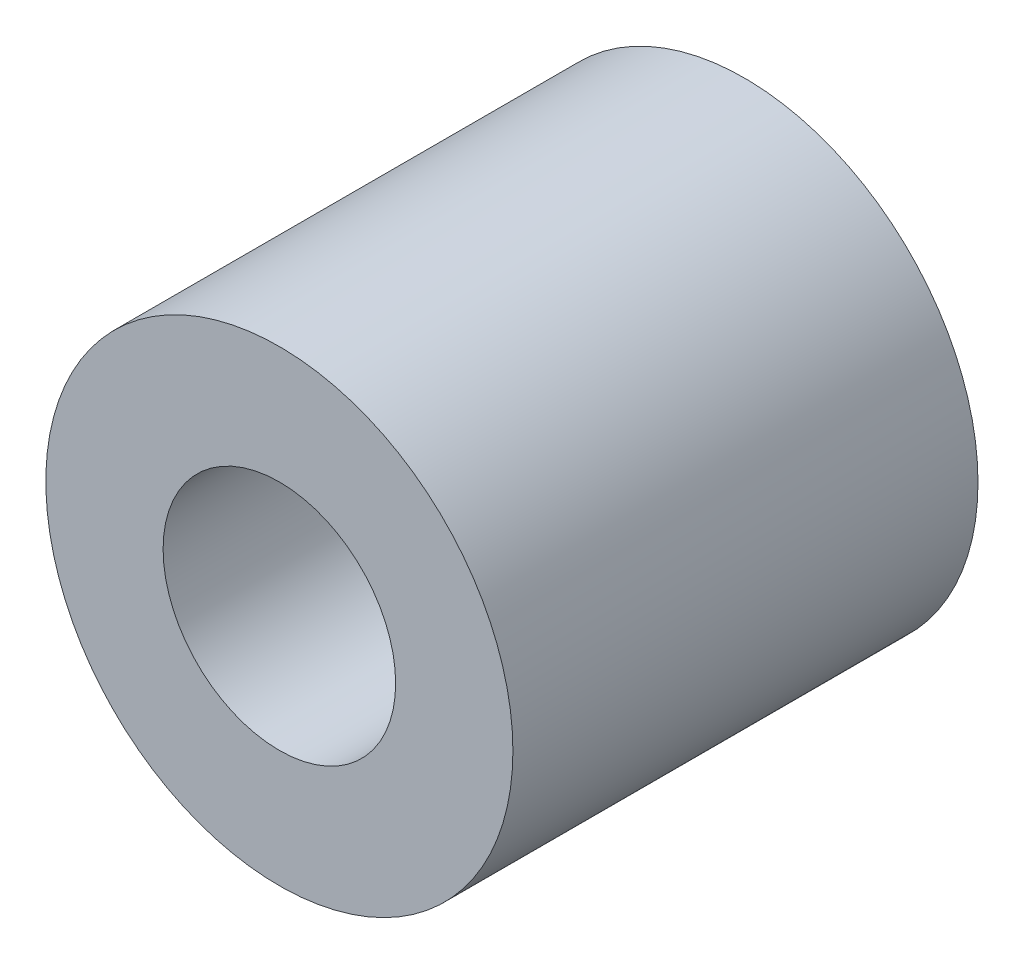
ISO-10303-21;
HEADER;
FILE_DESCRIPTION(('STEP AP214'),'2;1');
FILE_NAME('part.step','',(''),(''),'','','');
FILE_SCHEMA(('AUTOMOTIVE_DESIGN { 1 0 10303 214 1 1 1 1 }'));
ENDSEC;
DATA;
#1=APPLICATION_CONTEXT('core data for automotive mechanical design processes');
#2=APPLICATION_PROTOCOL_DEFINITION('international standard','automotive_design',2000,#1);
#3=PRODUCT_CONTEXT('',#1,'mechanical');
#4=PRODUCT('Part','Part','',(#3));
#5=PRODUCT_RELATED_PRODUCT_CATEGORY('part','',(#4));
#6=PRODUCT_DEFINITION_FORMATION('','',#4);
#7=PRODUCT_DEFINITION_CONTEXT('part definition',#1,'design');
#8=PRODUCT_DEFINITION('design','',#6,#7);
#9=PRODUCT_DEFINITION_SHAPE('','',#8);
#10=(LENGTH_UNIT() NAMED_UNIT(*) SI_UNIT(.MILLI.,.METRE.));
#11=(NAMED_UNIT(*) PLANE_ANGLE_UNIT() SI_UNIT($,.RADIAN.));
#12=(NAMED_UNIT(*) SI_UNIT($,.STERADIAN.) SOLID_ANGLE_UNIT());
#13=UNCERTAINTY_MEASURE_WITH_UNIT(LENGTH_MEASURE(1.E-05),#10,'distance_accuracy_value','');
#14=(GEOMETRIC_REPRESENTATION_CONTEXT(3) GLOBAL_UNCERTAINTY_ASSIGNED_CONTEXT((#13)) GLOBAL_UNIT_ASSIGNED_CONTEXT((#10,
#11,#12)) REPRESENTATION_CONTEXT('',''));
#15=CARTESIAN_POINT('',(0.,0.,0.));
#16=DIRECTION('',(0.,0.,1.));
#17=DIRECTION('',(1.,0.,0.));
#18=AXIS2_PLACEMENT_3D('',#15,#16,#17);
#19=CARTESIAN_POINT('',(0.,0.,6.));
#20=DIRECTION('',(0.,0.,1.));
#21=DIRECTION('',(1.,0.,0.));
#22=AXIS2_PLACEMENT_3D('',#19,#20,#21);
#23=PLANE('',#22);
#24=CARTESIAN_POINT('',(0.,0.,6.));
#25=DIRECTION('',(0.,0.,1.));
#26=DIRECTION('',(1.,0.,0.));
#27=AXIS2_PLACEMENT_3D('',#24,#25,#26);
#28=CIRCLE('',#27,6.0255);
#29=CARTESIAN_POINT('',(6.0255,0.,6.));
#30=VERTEX_POINT('',#29);
#31=EDGE_CURVE('E10',#30,#30,#28,.T.);
#32=ORIENTED_EDGE('',*,*,#31,.T.);
#33=EDGE_LOOP('',(#32));
#34=FACE_BOUND('',#33,.T.);
#35=CARTESIAN_POINT('',(0.,0.,6.));
#36=DIRECTION('',(0.,0.,1.));
#37=DIRECTION('',(1.,0.,0.));
#38=AXIS2_PLACEMENT_3D('',#35,#36,#37);
#39=CIRCLE('',#38,3.);
#40=CARTESIAN_POINT('',(3.,0.,6.));
#41=VERTEX_POINT('',#40);
#42=EDGE_CURVE('E41',#41,#41,#39,.T.);
#43=ORIENTED_EDGE('',*,*,#42,.F.);
#44=EDGE_LOOP('',(#43));
#45=FACE_BOUND('',#44,.T.);
#46=ADVANCED_FACE('F34',(#34,#45),#23,.T.);
#47=CARTESIAN_POINT('',(0.,0.,6.));
#48=DIRECTION('',(0.,0.,-1.));
#49=DIRECTION('',(-1.,0.,0.));
#50=AXIS2_PLACEMENT_3D('',#47,#48,#49);
#51=CYLINDRICAL_SURFACE('',#50,6.0255);
#52=ORIENTED_EDGE('',*,*,#31,.F.);
#53=EDGE_LOOP('',(#52));
#54=FACE_BOUND('',#53,.T.);
#55=CARTESIAN_POINT('',(0.,0.,-6.));
#56=DIRECTION('',(0.,0.,1.));
#57=DIRECTION('',(1.,0.,0.));
#58=AXIS2_PLACEMENT_3D('',#55,#56,#57);
#59=CIRCLE('',#58,6.0255);
#60=CARTESIAN_POINT('',(6.0255,0.,-6.));
#61=VERTEX_POINT('',#60);
#62=EDGE_CURVE('E45',#61,#61,#59,.T.);
#63=ORIENTED_EDGE('',*,*,#62,.T.);
#64=EDGE_LOOP('',(#63));
#65=FACE_BOUND('',#64,.T.);
#66=ADVANCED_FACE('F36',(#54,#65),#51,.T.);
#67=CARTESIAN_POINT('',(0.,0.,6.));
#68=DIRECTION('',(0.,0.,-1.));
#69=DIRECTION('',(-1.,0.,0.));
#70=AXIS2_PLACEMENT_3D('',#67,#68,#69);
#71=CYLINDRICAL_SURFACE('',#70,3.);
#72=ORIENTED_EDGE('',*,*,#42,.T.);
#73=EDGE_LOOP('',(#72));
#74=FACE_BOUND('',#73,.T.);
#75=CARTESIAN_POINT('',(0.,0.,-6.));
#76=DIRECTION('',(0.,0.,1.));
#77=DIRECTION('',(1.,0.,0.));
#78=AXIS2_PLACEMENT_3D('',#75,#76,#77);
#79=CIRCLE('',#78,3.);
#80=CARTESIAN_POINT('',(3.,0.,-6.));
#81=VERTEX_POINT('',#80);
#82=EDGE_CURVE('E49',#81,#81,#79,.T.);
#83=ORIENTED_EDGE('',*,*,#82,.F.);
#84=EDGE_LOOP('',(#83));
#85=FACE_BOUND('',#84,.T.);
#86=ADVANCED_FACE('F58',(#74,#85),#71,.F.);
#87=CARTESIAN_POINT('',(0.,0.,-6.));
#88=DIRECTION('',(0.,0.,1.));
#89=DIRECTION('',(1.,0.,0.));
#90=AXIS2_PLACEMENT_3D('',#87,#88,#89);
#91=PLANE('',#90);
#92=ORIENTED_EDGE('',*,*,#82,.T.);
#93=EDGE_LOOP('',(#92));
#94=FACE_BOUND('',#93,.T.);
#95=ORIENTED_EDGE('',*,*,#62,.F.);
#96=EDGE_LOOP('',(#95));
#97=FACE_BOUND('',#96,.T.);
#98=ADVANCED_FACE('F55',(#94,#97),#91,.F.);
#99=CLOSED_SHELL('',(#46,#66,#86,#98));
#100=MANIFOLD_SOLID_BREP('B2',#99);
#101=ADVANCED_BREP_SHAPE_REPRESENTATION('',(#18,#100),#14);
#102=SHAPE_DEFINITION_REPRESENTATION(#9,#101);
ENDSEC;
END-ISO-10303-21;
